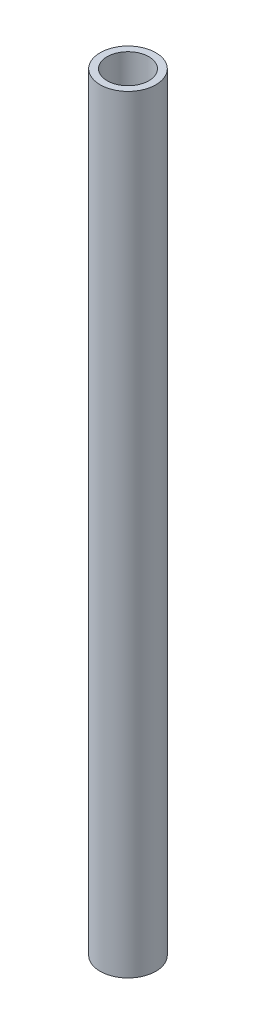
ISO-10303-21;
HEADER;
FILE_DESCRIPTION(('STEP AP214'),'2;1');
FILE_NAME('part.step','',(''),(''),'','','');
FILE_SCHEMA(('AUTOMOTIVE_DESIGN { 1 0 10303 214 1 1 1 1 }'));
ENDSEC;
DATA;
#1=APPLICATION_CONTEXT('core data for automotive mechanical design processes');
#2=APPLICATION_PROTOCOL_DEFINITION('international standard','automotive_design',2000,#1);
#3=PRODUCT_CONTEXT('',#1,'mechanical');
#4=PRODUCT('Part','Part','',(#3));
#5=PRODUCT_RELATED_PRODUCT_CATEGORY('part','',(#4));
#6=PRODUCT_DEFINITION_FORMATION('','',#4);
#7=PRODUCT_DEFINITION_CONTEXT('part definition',#1,'design');
#8=PRODUCT_DEFINITION('design','',#6,#7);
#9=PRODUCT_DEFINITION_SHAPE('','',#8);
#10=(LENGTH_UNIT() NAMED_UNIT(*) SI_UNIT(.MILLI.,.METRE.));
#11=(NAMED_UNIT(*) PLANE_ANGLE_UNIT() SI_UNIT($,.RADIAN.));
#12=(NAMED_UNIT(*) SI_UNIT($,.STERADIAN.) SOLID_ANGLE_UNIT());
#13=UNCERTAINTY_MEASURE_WITH_UNIT(LENGTH_MEASURE(1.E-05),#10,'distance_accuracy_value','');
#14=(GEOMETRIC_REPRESENTATION_CONTEXT(3) GLOBAL_UNCERTAINTY_ASSIGNED_CONTEXT((#13)) GLOBAL_UNIT_ASSIGNED_CONTEXT((#10,
#11,#12)) REPRESENTATION_CONTEXT('',''));
#15=CARTESIAN_POINT('',(0.,0.,0.));
#16=DIRECTION('',(0.,0.,1.));
#17=DIRECTION('',(1.,0.,0.));
#18=AXIS2_PLACEMENT_3D('',#15,#16,#17);
#19=CARTESIAN_POINT('',(-391.18166808322,350.52,-212.743279788072));
#20=DIRECTION('',(0.,1.,0.));
#21=DIRECTION('',(0.,0.,1.));
#22=AXIS2_PLACEMENT_3D('',#19,#20,#21);
#23=PLANE('',#22);
#24=CARTESIAN_POINT('',(-391.18166808322,350.52,-212.743279788072));
#25=DIRECTION('',(0.,1.,0.));
#26=DIRECTION('',(0.,0.,1.));
#27=AXIS2_PLACEMENT_3D('',#24,#25,#26);
#28=CIRCLE('',#27,12.7);
#29=CARTESIAN_POINT('',(-391.18166808322,350.52,-200.043279788072));
#30=VERTEX_POINT('',#29);
#31=EDGE_CURVE('E10',#30,#30,#28,.T.);
#32=ORIENTED_EDGE('',*,*,#31,.T.);
#33=EDGE_LOOP('',(#32));
#34=FACE_BOUND('',#33,.T.);
#35=CARTESIAN_POINT('',(-391.18166808322,350.52,-212.743279788072));
#36=DIRECTION('',(0.,1.,0.));
#37=DIRECTION('',(0.,0.,1.));
#38=AXIS2_PLACEMENT_3D('',#35,#36,#37);
#39=CIRCLE('',#38,9.52500000000002);
#40=CARTESIAN_POINT('',(-391.18166808322,350.52,-203.218279788071));
#41=VERTEX_POINT('',#40);
#42=EDGE_CURVE('E43',#41,#41,#39,.T.);
#43=ORIENTED_EDGE('',*,*,#42,.F.);
#44=EDGE_LOOP('',(#43));
#45=FACE_BOUND('',#44,.T.);
#46=ADVANCED_FACE('F32',(#34,#45),#23,.T.);
#47=CARTESIAN_POINT('',(-391.18166808322,0.,-212.743279788072));
#48=DIRECTION('',(0.,1.,0.));
#49=DIRECTION('',(0.,0.,1.));
#50=AXIS2_PLACEMENT_3D('',#47,#48,#49);
#51=PLANE('',#50);
#52=CARTESIAN_POINT('',(-391.18166808322,0.,-212.743279788072));
#53=DIRECTION('',(0.,1.,0.));
#54=DIRECTION('',(0.,0.,1.));
#55=AXIS2_PLACEMENT_3D('',#52,#53,#54);
#56=CIRCLE('',#55,12.7);
#57=CARTESIAN_POINT('',(-391.18166808322,0.,-200.043279788072));
#58=VERTEX_POINT('',#57);
#59=EDGE_CURVE('E36',#58,#58,#56,.T.);
#60=ORIENTED_EDGE('',*,*,#59,.F.);
#61=EDGE_LOOP('',(#60));
#62=FACE_BOUND('',#61,.T.);
#63=CARTESIAN_POINT('',(-391.18166808322,0.,-212.743279788072));
#64=DIRECTION('',(0.,1.,0.));
#65=DIRECTION('',(0.,0.,1.));
#66=AXIS2_PLACEMENT_3D('',#63,#64,#65);
#67=CIRCLE('',#66,9.52500000000002);
#68=CARTESIAN_POINT('',(-391.18166808322,0.,-203.218279788071));
#69=VERTEX_POINT('',#68);
#70=EDGE_CURVE('E45',#69,#69,#67,.T.);
#71=ORIENTED_EDGE('',*,*,#70,.T.);
#72=EDGE_LOOP('',(#71));
#73=FACE_BOUND('',#72,.T.);
#74=ADVANCED_FACE('F55',(#62,#73),#51,.F.);
#75=CARTESIAN_POINT('',(-391.18166808322,350.52,-212.743279788072));
#76=DIRECTION('',(0.,-1.,0.));
#77=DIRECTION('',(0.,0.,-1.));
#78=AXIS2_PLACEMENT_3D('',#75,#76,#77);
#79=CYLINDRICAL_SURFACE('',#78,12.7);
#80=ORIENTED_EDGE('',*,*,#31,.F.);
#81=EDGE_LOOP('',(#80));
#82=FACE_BOUND('',#81,.T.);
#83=ORIENTED_EDGE('',*,*,#59,.T.);
#84=EDGE_LOOP('',(#83));
#85=FACE_BOUND('',#84,.T.);
#86=ADVANCED_FACE('F34',(#82,#85),#79,.T.);
#87=CARTESIAN_POINT('',(-391.18166808322,350.52,-212.743279788072));
#88=DIRECTION('',(0.,-1.,0.));
#89=DIRECTION('',(0.,0.,-1.));
#90=AXIS2_PLACEMENT_3D('',#87,#88,#89);
#91=CYLINDRICAL_SURFACE('',#90,9.52500000000002);
#92=ORIENTED_EDGE('',*,*,#42,.T.);
#93=EDGE_LOOP('',(#92));
#94=FACE_BOUND('',#93,.T.);
#95=ORIENTED_EDGE('',*,*,#70,.F.);
#96=EDGE_LOOP('',(#95));
#97=FACE_BOUND('',#96,.T.);
#98=ADVANCED_FACE('F51',(#94,#97),#91,.F.);
#99=CLOSED_SHELL('',(#46,#74,#86,#98));
#100=MANIFOLD_SOLID_BREP('B2',#99);
#101=ADVANCED_BREP_SHAPE_REPRESENTATION('',(#18,#100),#14);
#102=SHAPE_DEFINITION_REPRESENTATION(#9,#101);
ENDSEC;
END-ISO-10303-21;
